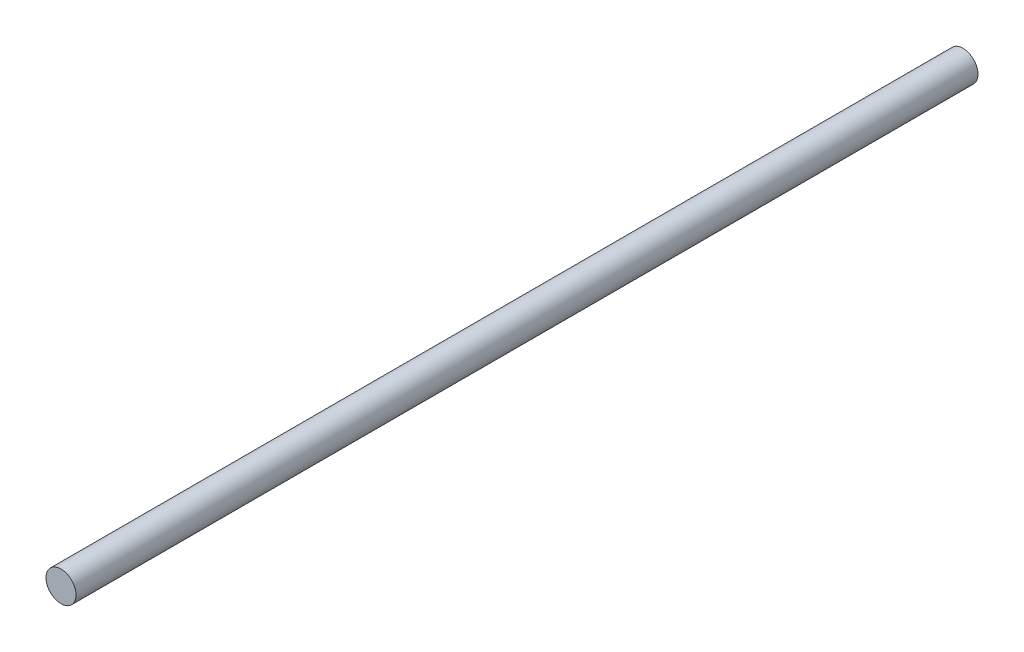
ISO-10303-21;
HEADER;
FILE_DESCRIPTION(('STEP AP214'),'2;1');
FILE_NAME('part.step','',(''),(''),'','','');
FILE_SCHEMA(('AUTOMOTIVE_DESIGN { 1 0 10303 214 1 1 1 1 }'));
ENDSEC;
DATA;
#1=APPLICATION_CONTEXT('core data for automotive mechanical design processes');
#2=APPLICATION_PROTOCOL_DEFINITION('international standard','automotive_design',2000,#1);
#3=PRODUCT_CONTEXT('',#1,'mechanical');
#4=PRODUCT('Part','Part','',(#3));
#5=PRODUCT_RELATED_PRODUCT_CATEGORY('part','',(#4));
#6=PRODUCT_DEFINITION_FORMATION('','',#4);
#7=PRODUCT_DEFINITION_CONTEXT('part definition',#1,'design');
#8=PRODUCT_DEFINITION('design','',#6,#7);
#9=PRODUCT_DEFINITION_SHAPE('','',#8);
#10=(LENGTH_UNIT() NAMED_UNIT(*) SI_UNIT(.MILLI.,.METRE.));
#11=(NAMED_UNIT(*) PLANE_ANGLE_UNIT() SI_UNIT($,.RADIAN.));
#12=(NAMED_UNIT(*) SI_UNIT($,.STERADIAN.) SOLID_ANGLE_UNIT());
#13=UNCERTAINTY_MEASURE_WITH_UNIT(LENGTH_MEASURE(1.E-05),#10,'distance_accuracy_value','');
#14=(GEOMETRIC_REPRESENTATION_CONTEXT(3) GLOBAL_UNCERTAINTY_ASSIGNED_CONTEXT((#13)) GLOBAL_UNIT_ASSIGNED_CONTEXT((#10,
#11,#12)) REPRESENTATION_CONTEXT('',''));
#15=CARTESIAN_POINT('',(0.,0.,0.));
#16=DIRECTION('',(0.,0.,1.));
#17=DIRECTION('',(1.,0.,0.));
#18=AXIS2_PLACEMENT_3D('',#15,#16,#17);
#19=CARTESIAN_POINT('',(0.,0.,600.));
#20=DIRECTION('',(0.,0.,-1.));
#21=DIRECTION('',(-1.,0.,0.));
#22=AXIS2_PLACEMENT_3D('',#19,#20,#21);
#23=CYLINDRICAL_SURFACE('',#22,10.);
#24=CARTESIAN_POINT('',(0.,0.,600.));
#25=DIRECTION('',(0.,0.,1.));
#26=DIRECTION('',(1.,0.,0.));
#27=AXIS2_PLACEMENT_3D('',#24,#25,#26);
#28=CIRCLE('',#27,10.);
#29=CARTESIAN_POINT('',(10.,0.,600.));
#30=VERTEX_POINT('',#29);
#31=EDGE_CURVE('E10',#30,#30,#28,.T.);
#32=ORIENTED_EDGE('',*,*,#31,.F.);
#33=EDGE_LOOP('',(#32));
#34=FACE_BOUND('',#33,.T.);
#35=CARTESIAN_POINT('',(0.,0.,0.));
#36=DIRECTION('',(0.,0.,1.));
#37=DIRECTION('',(1.,0.,0.));
#38=AXIS2_PLACEMENT_3D('',#35,#36,#37);
#39=CIRCLE('',#38,10.);
#40=CARTESIAN_POINT('',(10.,0.,0.));
#41=VERTEX_POINT('',#40);
#42=EDGE_CURVE('E44',#41,#41,#39,.T.);
#43=ORIENTED_EDGE('',*,*,#42,.T.);
#44=EDGE_LOOP('',(#43));
#45=FACE_BOUND('',#44,.T.);
#46=ADVANCED_FACE('F41',(#34,#45),#23,.T.);
#47=CARTESIAN_POINT('',(0.,0.,600.));
#48=DIRECTION('',(0.,0.,1.));
#49=DIRECTION('',(1.,0.,0.));
#50=AXIS2_PLACEMENT_3D('',#47,#48,#49);
#51=PLANE('',#50);
#52=ORIENTED_EDGE('',*,*,#31,.T.);
#53=EDGE_LOOP('',(#52));
#54=FACE_BOUND('',#53,.T.);
#55=ADVANCED_FACE('F74',(#54),#51,.T.);
#56=CARTESIAN_POINT('',(0.,0.,0.));
#57=DIRECTION('',(0.,0.,1.));
#58=DIRECTION('',(1.,0.,0.));
#59=AXIS2_PLACEMENT_3D('',#56,#57,#58);
#60=PLANE('',#59);
#61=CARTESIAN_POINT('',(0.,0.,0.));
#62=DIRECTION('',(0.,0.,-1.));
#63=DIRECTION('',(-1.,0.,0.));
#64=AXIS2_PLACEMENT_3D('',#61,#62,#63);
#65=CIRCLE('',#64,5.);
#66=CARTESIAN_POINT('',(-5.,0.,0.));
#67=VERTEX_POINT('',#66);
#68=EDGE_CURVE('E55',#67,#67,#65,.T.);
#69=ORIENTED_EDGE('',*,*,#68,.F.);
#70=EDGE_LOOP('',(#69));
#71=FACE_BOUND('',#70,.T.);
#72=ORIENTED_EDGE('',*,*,#42,.F.);
#73=EDGE_LOOP('',(#72));
#74=FACE_BOUND('',#73,.T.);
#75=ADVANCED_FACE('F68',(#71,#74),#60,.F.);
#76=CARTESIAN_POINT('',(0.,0.,150.));
#77=DIRECTION('',(0.,0.,-1.));
#78=DIRECTION('',(-1.,0.,0.));
#79=AXIS2_PLACEMENT_3D('',#76,#77,#78);
#80=CYLINDRICAL_SURFACE('',#79,5.);
#81=CARTESIAN_POINT('',(0.,0.,150.));
#82=DIRECTION('',(0.,0.,-1.));
#83=DIRECTION('',(-1.,0.,0.));
#84=AXIS2_PLACEMENT_3D('',#81,#82,#83);
#85=CIRCLE('',#84,5.);
#86=CARTESIAN_POINT('',(-5.,0.,150.));
#87=VERTEX_POINT('',#86);
#88=EDGE_CURVE('E53',#87,#87,#85,.T.);
#89=ORIENTED_EDGE('',*,*,#88,.F.);
#90=EDGE_LOOP('',(#89));
#91=FACE_BOUND('',#90,.T.);
#92=ORIENTED_EDGE('',*,*,#68,.T.);
#93=EDGE_LOOP('',(#92));
#94=FACE_BOUND('',#93,.T.);
#95=ADVANCED_FACE('F65',(#91,#94),#80,.F.);
#96=CARTESIAN_POINT('',(0.,0.,150.));
#97=DIRECTION('',(0.,0.,-1.));
#98=DIRECTION('',(-1.,0.,0.));
#99=AXIS2_PLACEMENT_3D('',#96,#97,#98);
#100=PLANE('',#99);
#101=ORIENTED_EDGE('',*,*,#88,.T.);
#102=EDGE_LOOP('',(#101));
#103=FACE_BOUND('',#102,.T.);
#104=ADVANCED_FACE('F63',(#103),#100,.T.);
#105=CLOSED_SHELL('',(#46,#55,#75,#95,#104));
#106=MANIFOLD_SOLID_BREP('B2',#105);
#107=ADVANCED_BREP_SHAPE_REPRESENTATION('',(#18,#106),#14);
#108=SHAPE_DEFINITION_REPRESENTATION(#9,#107);
ENDSEC;
END-ISO-10303-21;
